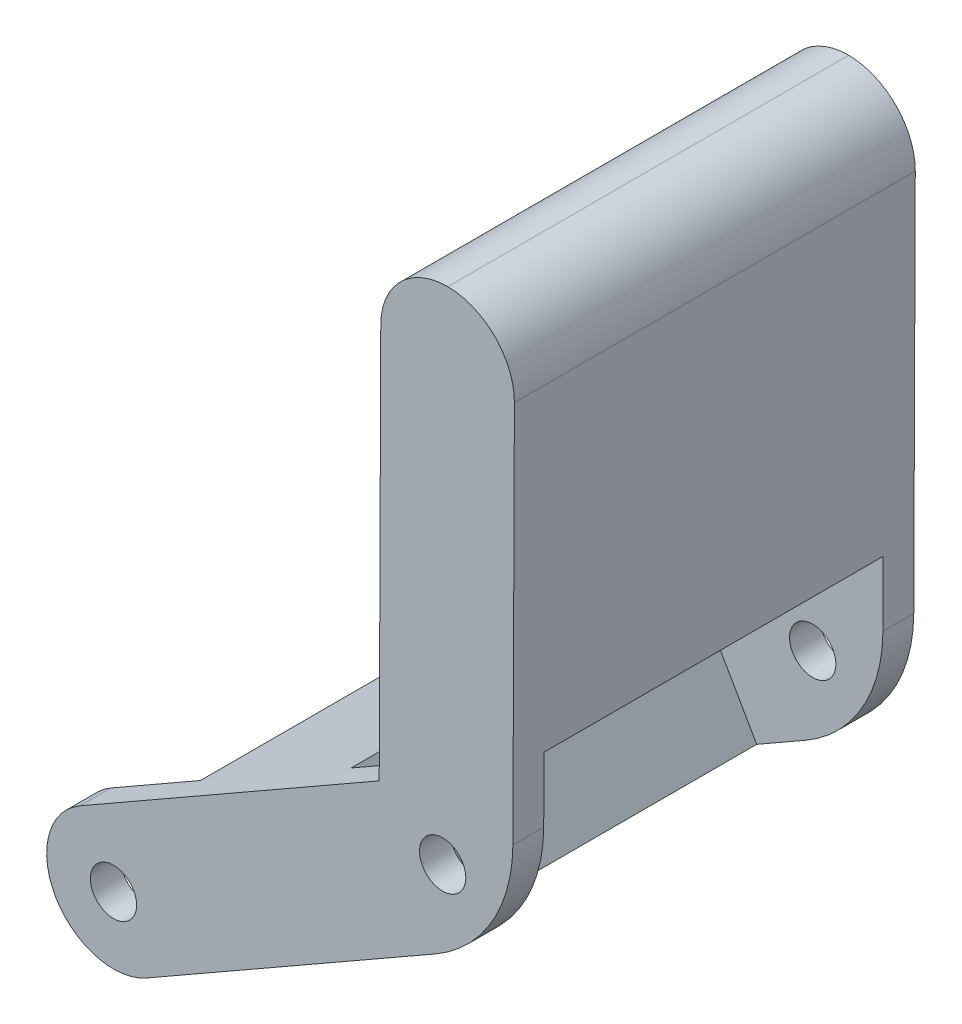
ISO-10303-21;
HEADER;
FILE_DESCRIPTION(('STEP AP214'),'2;1');
FILE_NAME('part.step','',(''),(''),'','','');
FILE_SCHEMA(('AUTOMOTIVE_DESIGN { 1 0 10303 214 1 1 1 1 }'));
ENDSEC;
DATA;
#1=APPLICATION_CONTEXT('core data for automotive mechanical design processes');
#2=APPLICATION_PROTOCOL_DEFINITION('international standard','automotive_design',2000,#1);
#3=PRODUCT_CONTEXT('',#1,'mechanical');
#4=PRODUCT('Part','Part','',(#3));
#5=PRODUCT_RELATED_PRODUCT_CATEGORY('part','',(#4));
#6=PRODUCT_DEFINITION_FORMATION('','',#4);
#7=PRODUCT_DEFINITION_CONTEXT('part definition',#1,'design');
#8=PRODUCT_DEFINITION('design','',#6,#7);
#9=PRODUCT_DEFINITION_SHAPE('','',#8);
#10=(LENGTH_UNIT() NAMED_UNIT(*) SI_UNIT(.MILLI.,.METRE.));
#11=(NAMED_UNIT(*) PLANE_ANGLE_UNIT() SI_UNIT($,.RADIAN.));
#12=(NAMED_UNIT(*) SI_UNIT($,.STERADIAN.) SOLID_ANGLE_UNIT());
#13=UNCERTAINTY_MEASURE_WITH_UNIT(LENGTH_MEASURE(1.E-05),#10,'distance_accuracy_value','');
#14=(GEOMETRIC_REPRESENTATION_CONTEXT(3) GLOBAL_UNCERTAINTY_ASSIGNED_CONTEXT((#13)) GLOBAL_UNIT_ASSIGNED_CONTEXT((#10,
#11,#12)) REPRESENTATION_CONTEXT('',''));
#15=CARTESIAN_POINT('',(0.,0.,0.));
#16=DIRECTION('',(0.,0.,1.));
#17=DIRECTION('',(1.,0.,0.));
#18=AXIS2_PLACEMENT_3D('',#15,#16,#17);
#19=CARTESIAN_POINT('',(-68.5457376919381,36.6889902020353,36.));
#20=DIRECTION('',(0.,0.,1.));
#21=DIRECTION('',(1.,0.,0.));
#22=AXIS2_PLACEMENT_3D('',#19,#20,#21);
#23=PLANE('',#22);
#24=CARTESIAN_POINT('',(-31.7182920612939,-14.593315758444,36.));
#25=DIRECTION('',(0.,0.,1.));
#26=DIRECTION('',(1.,0.,0.));
#27=AXIS2_PLACEMENT_3D('',#24,#25,#26);
#28=CIRCLE('',#27,2.25);
#29=CARTESIAN_POINT('',(-29.4682920612939,-14.593315758444,36.));
#30=VERTEX_POINT('',#29);
#31=EDGE_CURVE('E240',#30,#30,#28,.T.);
#32=ORIENTED_EDGE('',*,*,#31,.T.);
#33=EDGE_LOOP('',(#32));
#34=FACE_BOUND('',#33,.T.);
#35=DIRECTION('',(0.496581690759922,-0.867989990957279,0.));
#36=VECTOR('',#35,1.);
#37=CARTESIAN_POINT('',(-26.2661731416606,-3.98556390962247,36.0000000000014));
#38=LINE('',#37,#36);
#39=CARTESIAN_POINT('',(-26.2661731416606,-3.98556390962247,36.));
#40=VERTEX_POINT('',#39);
#41=CARTESIAN_POINT('',(-19.8106111617817,-15.2694337920671,36.0000000000014));
#42=VERTEX_POINT('',#41);
#43=EDGE_CURVE('E194',#40,#42,#38,.T.);
#44=ORIENTED_EDGE('',*,*,#43,.T.);
#45=DIRECTION('',(-0.867989990957278,-0.496581690759923,0.));
#46=VECTOR('',#45,1.);
#47=CARTESIAN_POINT('',(-34.1324460125767,-23.4630316896058,36.));
#48=LINE('',#47,#46);
#49=CARTESIAN_POINT('',(-28.4905110713544,-20.2352506996663,36.));
#50=VERTEX_POINT('',#49);
#51=EDGE_CURVE('E177',#42,#50,#48,.T.);
#52=ORIENTED_EDGE('',*,*,#51,.T.);
#53=CARTESIAN_POINT('',(-31.7182920612939,-14.593315758444,36.));
#54=DIRECTION('',(0.,0.,1.));
#55=DIRECTION('',(1.,0.,0.));
#56=AXIS2_PLACEMENT_3D('',#53,#54,#55);
#57=CIRCLE('',#56,6.5);
#58=CARTESIAN_POINT('',(-37.3602270025162,-17.8210967483835,36.));
#59=VERTEX_POINT('',#58);
#60=EDGE_CURVE('E312',#50,#59,#57,.F.);
#61=ORIENTED_EDGE('',*,*,#60,.T.);
#62=CARTESIAN_POINT('',(-31.7182920612939,-14.593315758444,36.));
#63=DIRECTION('',(0.,0.,1.));
#64=DIRECTION('',(1.,0.,0.));
#65=AXIS2_PLACEMENT_3D('',#62,#63,#64);
#66=CIRCLE('',#65,6.5);
#67=CARTESIAN_POINT('',(-34.9460730512334,-8.9513808172217,36.));
#68=VERTEX_POINT('',#67);
#69=EDGE_CURVE('E310',#59,#68,#66,.F.);
#70=ORIENTED_EDGE('',*,*,#69,.T.);
#71=DIRECTION('',(-0.867989990957279,-0.496581690759922,0.));
#72=VECTOR('',#71,1.);
#73=CARTESIAN_POINT('',(-5.86840835416459,7.6841058232357,36.));
#74=LINE('',#73,#72);
#75=EDGE_CURVE('E196',#40,#68,#74,.T.);
#76=ORIENTED_EDGE('',*,*,#75,.F.);
#77=EDGE_LOOP('',(#44,#52,#61,#70,#76));
#78=FACE_BOUND('',#77,.T.);
#79=ADVANCED_FACE('F33',(#34,#78),#23,.F.);
#80=CARTESIAN_POINT('',(0.306965546264745,3.72850446467224,36.));
#81=DIRECTION('',(0.,0.,1.));
#82=DIRECTION('',(1.,0.,0.));
#83=AXIS2_PLACEMENT_3D('',#80,#81,#82);
#84=CIRCLE('',#83,2.25);
#85=CARTESIAN_POINT('',(2.55696554626474,3.72850446467224,36.));
#86=VERTEX_POINT('',#85);
#87=EDGE_CURVE('E239',#86,#86,#84,.T.);
#88=ORIENTED_EDGE('',*,*,#87,.T.);
#89=EDGE_LOOP('',(#88));
#90=FACE_BOUND('',#89,.T.);
#91=DIRECTION('',(-0.496581690759922,0.867989990957279,0.));
#92=VECTOR('',#91,1.);
#93=CARTESIAN_POINT('',(-5.14515337336855,-6.8792473841493,36.0000000000014));
#94=LINE('',#93,#92);
#95=CARTESIAN_POINT('',(-5.14515337336855,-6.8792473841493,36.));
#96=VERTEX_POINT('',#95);
#97=CARTESIAN_POINT('',(-11.6007153532475,4.40462249829532,36.));
#98=VERTEX_POINT('',#97);
#99=EDGE_CURVE('E201',#96,#98,#94,.T.);
#100=ORIENTED_EDGE('',*,*,#99,.T.);
#101=CARTESIAN_POINT('',(-5.86840835416459,7.6841058232357,36.));
#102=VERTEX_POINT('',#101);
#103=EDGE_CURVE('E245',#102,#98,#74,.T.);
#104=ORIENTED_EDGE('',*,*,#103,.F.);
#105=DIRECTION('',(-0.00394263622631601,-0.99999222777959,0.));
#106=VECTOR('',#105,1.);
#107=CARTESIAN_POINT('',(-5.69098972398036,52.6837560733172,36.));
#108=LINE('',#107,#106);
#109=CARTESIAN_POINT('',(-5.75012926737511,37.6838726566235,36.));
#110=VERTEX_POINT('',#109);
#111=EDGE_CURVE('E248',#110,#102,#108,.T.);
#112=ORIENTED_EDGE('',*,*,#111,.F.);
#113=DIRECTION('',(0.496581690759923,-0.867989990957279,0.));
#114=VECTOR('',#113,1.);
#115=CARTESIAN_POINT('',(-20.8062881892878,64.000983193831,36.));
#116=LINE('',#115,#114);
#117=CARTESIAN_POINT('',(7.16099469238293,15.1161328917342,36.));
#118=VERTEX_POINT('',#117);
#119=EDGE_CURVE('E220',#110,#118,#116,.T.);
#120=ORIENTED_EDGE('',*,*,#119,.T.);
#121=DIRECTION('',(0.00394263622631592,0.99999222777959,0.));
#122=VECTOR('',#121,1.);
#123=CARTESIAN_POINT('',(7.10189893984454,0.127356387644555,36.));
#124=LINE('',#123,#122);
#125=CARTESIAN_POINT('',(7.13604317114325,8.78754311608577,36.));
#126=VERTEX_POINT('',#125);
#127=EDGE_CURVE('E243',#126,#118,#124,.T.);
#128=ORIENTED_EDGE('',*,*,#127,.F.);
#129=CARTESIAN_POINT('',(-7.8638402455506,8.84668265948051,36.));
#130=DIRECTION('',(0.,0.,1.));
#131=DIRECTION('',(1.,0.,0.));
#132=AXIS2_PLACEMENT_3D('',#129,#130,#131);
#133=CIRCLE('',#132,15.);
#134=CARTESIAN_POINT('',(-0.415114884151767,-4.17316720487868,36.));
#135=VERTEX_POINT('',#134);
#136=EDGE_CURVE('E332',#126,#135,#133,.F.);
#137=ORIENTED_EDGE('',*,*,#136,.T.);
#138=EDGE_CURVE('E190',#135,#96,#48,.T.);
#139=ORIENTED_EDGE('',*,*,#138,.T.);
#140=EDGE_LOOP('',(#100,#104,#112,#120,#128,#137,#139));
#141=FACE_BOUND('',#140,.T.);
#142=ADVANCED_FACE('F385',(#90,#141),#23,.F.);
#143=CARTESIAN_POINT('',(-68.5457376919381,36.6889902020353,3.));
#144=DIRECTION('',(0.,0.,-1.));
#145=DIRECTION('',(-1.,0.,0.));
#146=AXIS2_PLACEMENT_3D('',#143,#144,#145);
#147=PLANE('',#146);
#148=CARTESIAN_POINT('',(-31.7182920612939,-14.593315758444,3.));
#149=DIRECTION('',(0.,0.,-1.));
#150=DIRECTION('',(-1.,0.,0.));
#151=AXIS2_PLACEMENT_3D('',#148,#149,#150);
#152=CIRCLE('',#151,2.25);
#153=CARTESIAN_POINT('',(-33.9682920612939,-14.593315758444,3.));
#154=VERTEX_POINT('',#153);
#155=EDGE_CURVE('E226',#154,#154,#152,.T.);
#156=ORIENTED_EDGE('',*,*,#155,.T.);
#157=EDGE_LOOP('',(#156));
#158=FACE_BOUND('',#157,.T.);
#159=DIRECTION('',(0.496581690759922,-0.867989990957279,0.));
#160=VECTOR('',#159,1.);
#161=CARTESIAN_POINT('',(-26.2661731416606,-3.98556390962247,3.));
#162=LINE('',#161,#160);
#163=CARTESIAN_POINT('',(-26.2661731416606,-3.98556390962247,3.));
#164=VERTEX_POINT('',#163);
#165=CARTESIAN_POINT('',(-19.8106111617817,-15.2694337920671,3.));
#166=VERTEX_POINT('',#165);
#167=EDGE_CURVE('E204',#164,#166,#162,.T.);
#168=ORIENTED_EDGE('',*,*,#167,.F.);
#169=DIRECTION('',(0.867989990957279,0.496581690759922,0.));
#170=VECTOR('',#169,1.);
#171=CARTESIAN_POINT('',(-5.86840835416459,7.6841058232357,3.));
#172=LINE('',#171,#170);
#173=CARTESIAN_POINT('',(-34.9460730512334,-8.9513808172217,3.));
#174=VERTEX_POINT('',#173);
#175=EDGE_CURVE('E233',#174,#164,#172,.T.);
#176=ORIENTED_EDGE('',*,*,#175,.F.);
#177=CARTESIAN_POINT('',(-31.7182920612939,-14.593315758444,3.));
#178=DIRECTION('',(0.,0.,-1.));
#179=DIRECTION('',(-1.,0.,0.));
#180=AXIS2_PLACEMENT_3D('',#177,#178,#179);
#181=CIRCLE('',#180,6.5);
#182=CARTESIAN_POINT('',(-37.3602270025162,-17.8210967483835,3.));
#183=VERTEX_POINT('',#182);
#184=EDGE_CURVE('E303',#174,#183,#181,.F.);
#185=ORIENTED_EDGE('',*,*,#184,.T.);
#186=CARTESIAN_POINT('',(-31.7182920612939,-14.593315758444,3.));
#187=DIRECTION('',(0.,0.,-1.));
#188=DIRECTION('',(-1.,0.,0.));
#189=AXIS2_PLACEMENT_3D('',#186,#187,#188);
#190=CIRCLE('',#189,6.5);
#191=CARTESIAN_POINT('',(-28.4905110713544,-20.2352506996663,3.));
#192=VERTEX_POINT('',#191);
#193=EDGE_CURVE('E305',#183,#192,#190,.F.);
#194=ORIENTED_EDGE('',*,*,#193,.T.);
#195=DIRECTION('',(0.867989990957278,0.496581690759923,0.));
#196=VECTOR('',#195,1.);
#197=CARTESIAN_POINT('',(-34.1324460125767,-23.4630316896058,3.));
#198=LINE('',#197,#196);
#199=EDGE_CURVE('E191',#192,#166,#198,.T.);
#200=ORIENTED_EDGE('',*,*,#199,.T.);
#201=EDGE_LOOP('',(#168,#176,#185,#194,#200));
#202=FACE_BOUND('',#201,.T.);
#203=ADVANCED_FACE('F391',(#158,#202),#147,.F.);
#204=CARTESIAN_POINT('',(0.306965546264745,3.72850446467224,3.));
#205=DIRECTION('',(0.,0.,-1.));
#206=DIRECTION('',(-1.,0.,0.));
#207=AXIS2_PLACEMENT_3D('',#204,#205,#206);
#208=CIRCLE('',#207,2.25);
#209=CARTESIAN_POINT('',(-1.94303445373526,3.72850446467224,3.));
#210=VERTEX_POINT('',#209);
#211=EDGE_CURVE('E223',#210,#210,#208,.T.);
#212=ORIENTED_EDGE('',*,*,#211,.T.);
#213=EDGE_LOOP('',(#212));
#214=FACE_BOUND('',#213,.T.);
#215=DIRECTION('',(-0.496581690759922,0.867989990957279,0.));
#216=VECTOR('',#215,1.);
#217=CARTESIAN_POINT('',(-5.14515337336855,-6.8792473841493,3.));
#218=LINE('',#217,#216);
#219=CARTESIAN_POINT('',(-5.14515337336855,-6.8792473841493,3.));
#220=VERTEX_POINT('',#219);
#221=CARTESIAN_POINT('',(-11.6007153532475,4.40462249829532,3.));
#222=VERTEX_POINT('',#221);
#223=EDGE_CURVE('E214',#220,#222,#218,.T.);
#224=ORIENTED_EDGE('',*,*,#223,.F.);
#225=CARTESIAN_POINT('',(-0.415114884151774,-4.17316720487868,3.));
#226=VERTEX_POINT('',#225);
#227=EDGE_CURVE('E217',#220,#226,#198,.T.);
#228=ORIENTED_EDGE('',*,*,#227,.T.);
#229=CARTESIAN_POINT('',(-7.8638402455506,8.84668265948051,3.));
#230=DIRECTION('',(0.,0.,-1.));
#231=DIRECTION('',(-1.,0.,0.));
#232=AXIS2_PLACEMENT_3D('',#229,#230,#231);
#233=CIRCLE('',#232,15.);
#234=CARTESIAN_POINT('',(7.13604317114325,8.78754311608577,3.));
#235=VERTEX_POINT('',#234);
#236=EDGE_CURVE('E343',#226,#235,#233,.F.);
#237=ORIENTED_EDGE('',*,*,#236,.T.);
#238=DIRECTION('',(-0.00394263622631592,-0.99999222777959,0.));
#239=VECTOR('',#238,1.);
#240=CARTESIAN_POINT('',(7.10189893984454,0.127356387644555,3.));
#241=LINE('',#240,#239);
#242=CARTESIAN_POINT('',(7.16099469238293,15.1161328917342,3.));
#243=VERTEX_POINT('',#242);
#244=EDGE_CURVE('E229',#243,#235,#241,.T.);
#245=ORIENTED_EDGE('',*,*,#244,.F.);
#246=DIRECTION('',(0.496581690759923,-0.867989990957279,0.));
#247=VECTOR('',#246,1.);
#248=CARTESIAN_POINT('',(-20.8062881892877,64.000983193831,3.));
#249=LINE('',#248,#247);
#250=CARTESIAN_POINT('',(-5.75012926737511,37.6838726566235,3.));
#251=VERTEX_POINT('',#250);
#252=EDGE_CURVE('E219',#251,#243,#249,.T.);
#253=ORIENTED_EDGE('',*,*,#252,.F.);
#254=DIRECTION('',(0.00394263622631601,0.99999222777959,0.));
#255=VECTOR('',#254,1.);
#256=CARTESIAN_POINT('',(-5.69098972398036,52.6837560733172,3.));
#257=LINE('',#256,#255);
#258=CARTESIAN_POINT('',(-5.86840835416459,7.6841058232357,3.));
#259=VERTEX_POINT('',#258);
#260=EDGE_CURVE('E236',#259,#251,#257,.T.);
#261=ORIENTED_EDGE('',*,*,#260,.F.);
#262=EDGE_CURVE('E232',#222,#259,#172,.T.);
#263=ORIENTED_EDGE('',*,*,#262,.F.);
#264=EDGE_LOOP('',(#224,#228,#237,#245,#253,#261,#263));
#265=FACE_BOUND('',#264,.T.);
#266=ADVANCED_FACE('F402',(#214,#265),#147,.F.);
#267=CARTESIAN_POINT('',(-31.7182920612939,-14.593315758444,39.));
#268=DIRECTION('',(0.,0.,-1.));
#269=DIRECTION('',(-1.,0.,0.));
#270=AXIS2_PLACEMENT_3D('',#267,#268,#269);
#271=CYLINDRICAL_SURFACE('',#270,2.25);
#272=ORIENTED_EDGE('',*,*,#31,.F.);
#273=EDGE_LOOP('',(#272));
#274=FACE_BOUND('',#273,.T.);
#275=CARTESIAN_POINT('',(-31.7182920612939,-14.593315758444,39.));
#276=DIRECTION('',(0.,0.,1.));
#277=DIRECTION('',(1.,0.,0.));
#278=AXIS2_PLACEMENT_3D('',#275,#276,#277);
#279=CIRCLE('',#278,2.25);
#280=CARTESIAN_POINT('',(-29.4682920612939,-14.593315758444,39.));
#281=VERTEX_POINT('',#280);
#282=EDGE_CURVE('E261',#281,#281,#279,.T.);
#283=ORIENTED_EDGE('',*,*,#282,.T.);
#284=EDGE_LOOP('',(#283));
#285=FACE_BOUND('',#284,.T.);
#286=ADVANCED_FACE('F413',(#274,#285),#271,.F.);
#287=CARTESIAN_POINT('',(0.306965546264745,3.72850446467224,39.));
#288=DIRECTION('',(0.,0.,-1.));
#289=DIRECTION('',(-1.,0.,0.));
#290=AXIS2_PLACEMENT_3D('',#287,#288,#289);
#291=CYLINDRICAL_SURFACE('',#290,2.25);
#292=ORIENTED_EDGE('',*,*,#87,.F.);
#293=EDGE_LOOP('',(#292));
#294=FACE_BOUND('',#293,.T.);
#295=CARTESIAN_POINT('',(0.306965546264745,3.72850446467224,39.));
#296=DIRECTION('',(0.,0.,1.));
#297=DIRECTION('',(1.,0.,0.));
#298=AXIS2_PLACEMENT_3D('',#295,#296,#297);
#299=CIRCLE('',#298,2.25);
#300=CARTESIAN_POINT('',(2.55696554626474,3.72850446467224,39.));
#301=VERTEX_POINT('',#300);
#302=EDGE_CURVE('E255',#301,#301,#299,.T.);
#303=ORIENTED_EDGE('',*,*,#302,.T.);
#304=EDGE_LOOP('',(#303));
#305=FACE_BOUND('',#304,.T.);
#306=ADVANCED_FACE('F408',(#294,#305),#291,.F.);
#307=CARTESIAN_POINT('',(0.,0.,39.));
#308=DIRECTION('',(0.,0.,1.));
#309=DIRECTION('',(1.,0.,0.));
#310=AXIS2_PLACEMENT_3D('',#307,#308,#309);
#311=PLANE('',#310);
#312=ORIENTED_EDGE('',*,*,#282,.F.);
#313=EDGE_LOOP('',(#312));
#314=FACE_BOUND('',#313,.T.);
#315=CARTESIAN_POINT('',(0.783332621115914,46.1581794572789,39.));
#316=DIRECTION('',(0.,0.,1.));
#317=DIRECTION('',(1.,0.,0.));
#318=AXIS2_PLACEMENT_3D('',#315,#316,#317);
#319=CIRCLE('',#318,6.5);
#320=CARTESIAN_POINT('',(7.28328210168325,46.1325523218078,39.));
#321=VERTEX_POINT('',#320);
#322=CARTESIAN_POINT('',(0.808959756586968,52.6581289378462,39.));
#323=VERTEX_POINT('',#322);
#324=EDGE_CURVE('E49',#321,#323,#319,.T.);
#325=ORIENTED_EDGE('',*,*,#324,.T.);
#326=CARTESIAN_POINT('',(0.783332621115915,46.1581794572789,39.));
#327=DIRECTION('',(0.,0.,1.));
#328=DIRECTION('',(1.,0.,0.));
#329=AXIS2_PLACEMENT_3D('',#326,#327,#328);
#330=CIRCLE('',#329,6.5);
#331=CARTESIAN_POINT('',(-5.71661685945142,46.1838065927499,39.));
#332=VERTEX_POINT('',#331);
#333=EDGE_CURVE('E42',#323,#332,#330,.T.);
#334=ORIENTED_EDGE('',*,*,#333,.T.);
#335=DIRECTION('',(-0.00394263622631601,-0.99999222777959,0.));
#336=VECTOR('',#335,1.);
#337=CARTESIAN_POINT('',(-5.69098972398036,52.6837560733172,39.));
#338=LINE('',#337,#336);
#339=CARTESIAN_POINT('',(-5.86840835416459,7.6841058232357,39.));
#340=VERTEX_POINT('',#339);
#341=EDGE_CURVE('E267',#332,#340,#338,.T.);
#342=ORIENTED_EDGE('',*,*,#341,.T.);
#343=DIRECTION('',(-0.867989990957279,-0.496581690759922,0.));
#344=VECTOR('',#343,1.);
#345=CARTESIAN_POINT('',(-5.86840835416459,7.6841058232357,39.));
#346=LINE('',#345,#344);
#347=CARTESIAN_POINT('',(-34.9460730512334,-8.9513808172217,39.));
#348=VERTEX_POINT('',#347);
#349=EDGE_CURVE('E269',#340,#348,#346,.T.);
#350=ORIENTED_EDGE('',*,*,#349,.T.);
#351=CARTESIAN_POINT('',(-31.7182920612939,-14.593315758444,39.));
#352=DIRECTION('',(0.,0.,1.));
#353=DIRECTION('',(1.,0.,0.));
#354=AXIS2_PLACEMENT_3D('',#351,#352,#353);
#355=CIRCLE('',#354,6.5);
#356=CARTESIAN_POINT('',(-37.3602270025163,-17.8210967483835,39.));
#357=VERTEX_POINT('',#356);
#358=EDGE_CURVE('E314',#348,#357,#355,.T.);
#359=ORIENTED_EDGE('',*,*,#358,.T.);
#360=CARTESIAN_POINT('',(-31.7182920612939,-14.593315758444,39.));
#361=DIRECTION('',(0.,0.,1.));
#362=DIRECTION('',(1.,0.,0.));
#363=AXIS2_PLACEMENT_3D('',#360,#361,#362);
#364=CIRCLE('',#363,6.5);
#365=CARTESIAN_POINT('',(-28.4905110713544,-20.2352506996663,39.));
#366=VERTEX_POINT('',#365);
#367=EDGE_CURVE('E316',#357,#366,#364,.T.);
#368=ORIENTED_EDGE('',*,*,#367,.T.);
#369=DIRECTION('',(0.867989990957279,0.496581690759923,0.));
#370=VECTOR('',#369,1.);
#371=CARTESIAN_POINT('',(-34.1324460125768,-23.4630316896058,39.));
#372=LINE('',#371,#370);
#373=CARTESIAN_POINT('',(-0.41511488415176,-4.17316720487867,39.));
#374=VERTEX_POINT('',#373);
#375=EDGE_CURVE('E273',#366,#374,#372,.T.);
#376=ORIENTED_EDGE('',*,*,#375,.T.);
#377=CARTESIAN_POINT('',(-7.8638402455506,8.84668265948051,39.));
#378=DIRECTION('',(0.,0.,1.));
#379=DIRECTION('',(1.,0.,0.));
#380=AXIS2_PLACEMENT_3D('',#377,#378,#379);
#381=CIRCLE('',#380,15.);
#382=CARTESIAN_POINT('',(7.13604317114325,8.78754311608577,39.));
#383=VERTEX_POINT('',#382);
#384=EDGE_CURVE('E336',#374,#383,#381,.T.);
#385=ORIENTED_EDGE('',*,*,#384,.T.);
#386=DIRECTION('',(0.00394263622631592,0.99999222777959,0.));
#387=VECTOR('',#386,1.);
#388=CARTESIAN_POINT('',(7.10189893984454,0.127356387644555,39.));
#389=LINE('',#388,#387);
#390=EDGE_CURVE('E276',#383,#321,#389,.T.);
#391=ORIENTED_EDGE('',*,*,#390,.T.);
#392=EDGE_LOOP('',(#325,#334,#342,#350,#359,#368,#376,#385,#391));
#393=FACE_BOUND('',#392,.T.);
#394=ORIENTED_EDGE('',*,*,#302,.F.);
#395=EDGE_LOOP('',(#394));
#396=FACE_BOUND('',#395,.T.);
#397=ADVANCED_FACE('F355',(#314,#393,#396),#311,.T.);
#398=CARTESIAN_POINT('',(0.,0.,0.));
#399=DIRECTION('',(0.,0.,1.));
#400=DIRECTION('',(1.,0.,0.));
#401=AXIS2_PLACEMENT_3D('',#398,#399,#400);
#402=PLANE('',#401);
#403=DIRECTION('',(-0.00394263622631601,-0.99999222777959,0.));
#404=VECTOR('',#403,1.);
#405=CARTESIAN_POINT('',(-5.69098972398036,52.6837560733172,0.));
#406=LINE('',#405,#404);
#407=CARTESIAN_POINT('',(-5.71661685945142,46.1838065927499,0.));
#408=VERTEX_POINT('',#407);
#409=CARTESIAN_POINT('',(-5.86840835416459,7.6841058232357,0.));
#410=VERTEX_POINT('',#409);
#411=EDGE_CURVE('E264',#408,#410,#406,.T.);
#412=ORIENTED_EDGE('',*,*,#411,.F.);
#413=CARTESIAN_POINT('',(0.783332621115915,46.1581794572789,0.));
#414=DIRECTION('',(0.,0.,1.));
#415=DIRECTION('',(1.,0.,0.));
#416=AXIS2_PLACEMENT_3D('',#413,#414,#415);
#417=CIRCLE('',#416,6.5);
#418=CARTESIAN_POINT('',(0.808959756586968,52.6581289378462,0.));
#419=VERTEX_POINT('',#418);
#420=EDGE_CURVE('E350',#408,#419,#417,.F.);
#421=ORIENTED_EDGE('',*,*,#420,.T.);
#422=CARTESIAN_POINT('',(0.783332621115914,46.1581794572789,0.));
#423=DIRECTION('',(0.,0.,1.));
#424=DIRECTION('',(1.,0.,0.));
#425=AXIS2_PLACEMENT_3D('',#422,#423,#424);
#426=CIRCLE('',#425,6.5);
#427=CARTESIAN_POINT('',(7.28328210168325,46.1325523218078,0.));
#428=VERTEX_POINT('',#427);
#429=EDGE_CURVE('E348',#419,#428,#426,.F.);
#430=ORIENTED_EDGE('',*,*,#429,.T.);
#431=DIRECTION('',(0.00394263622631592,0.99999222777959,0.));
#432=VECTOR('',#431,1.);
#433=CARTESIAN_POINT('',(7.10189893984454,0.127356387644555,0.));
#434=LINE('',#433,#432);
#435=CARTESIAN_POINT('',(7.13604317114325,8.78754311608577,0.));
#436=VERTEX_POINT('',#435);
#437=EDGE_CURVE('E270',#436,#428,#434,.T.);
#438=ORIENTED_EDGE('',*,*,#437,.F.);
#439=CARTESIAN_POINT('',(-7.8638402455506,8.84668265948051,0.));
#440=DIRECTION('',(0.,0.,1.));
#441=DIRECTION('',(1.,0.,0.));
#442=AXIS2_PLACEMENT_3D('',#439,#440,#441);
#443=CIRCLE('',#442,15.);
#444=CARTESIAN_POINT('',(-0.41511488415176,-4.17316720487867,0.));
#445=VERTEX_POINT('',#444);
#446=EDGE_CURVE('E338',#436,#445,#443,.F.);
#447=ORIENTED_EDGE('',*,*,#446,.T.);
#448=DIRECTION('',(0.867989990957279,0.496581690759923,0.));
#449=VECTOR('',#448,1.);
#450=CARTESIAN_POINT('',(-34.1324460125768,-23.4630316896058,0.));
#451=LINE('',#450,#449);
#452=CARTESIAN_POINT('',(-28.4905110713544,-20.2352506996663,0.));
#453=VERTEX_POINT('',#452);
#454=EDGE_CURVE('E283',#453,#445,#451,.T.);
#455=ORIENTED_EDGE('',*,*,#454,.F.);
#456=CARTESIAN_POINT('',(-31.7182920612939,-14.593315758444,0.));
#457=DIRECTION('',(0.,0.,1.));
#458=DIRECTION('',(1.,0.,0.));
#459=AXIS2_PLACEMENT_3D('',#456,#457,#458);
#460=CIRCLE('',#459,6.5);
#461=CARTESIAN_POINT('',(-37.3602270025163,-17.8210967483835,0.));
#462=VERTEX_POINT('',#461);
#463=EDGE_CURVE('E301',#453,#462,#460,.F.);
#464=ORIENTED_EDGE('',*,*,#463,.T.);
#465=CARTESIAN_POINT('',(-31.7182920612939,-14.593315758444,0.));
#466=DIRECTION('',(0.,0.,1.));
#467=DIRECTION('',(1.,0.,0.));
#468=AXIS2_PLACEMENT_3D('',#465,#466,#467);
#469=CIRCLE('',#468,6.5);
#470=CARTESIAN_POINT('',(-34.9460730512334,-8.9513808172217,0.));
#471=VERTEX_POINT('',#470);
#472=EDGE_CURVE('E299',#462,#471,#469,.F.);
#473=ORIENTED_EDGE('',*,*,#472,.T.);
#474=DIRECTION('',(-0.867989990957279,-0.496581690759922,0.));
#475=VECTOR('',#474,1.);
#476=CARTESIAN_POINT('',(-5.86840835416459,7.6841058232357,0.));
#477=LINE('',#476,#475);
#478=EDGE_CURVE('E280',#410,#471,#477,.T.);
#479=ORIENTED_EDGE('',*,*,#478,.F.);
#480=EDGE_LOOP('',(#412,#421,#430,#438,#447,#455,#464,#473,#479));
#481=FACE_BOUND('',#480,.T.);
#482=CARTESIAN_POINT('',(-31.7182920612939,-14.593315758444,0.));
#483=DIRECTION('',(0.,0.,1.));
#484=DIRECTION('',(1.,0.,0.));
#485=AXIS2_PLACEMENT_3D('',#482,#483,#484);
#486=CIRCLE('',#485,2.25);
#487=CARTESIAN_POINT('',(-29.4682920612939,-14.593315758444,0.));
#488=VERTEX_POINT('',#487);
#489=EDGE_CURVE('E258',#488,#488,#486,.T.);
#490=ORIENTED_EDGE('',*,*,#489,.T.);
#491=EDGE_LOOP('',(#490));
#492=FACE_BOUND('',#491,.T.);
#493=CARTESIAN_POINT('',(0.306965546264745,3.72850446467224,0.));
#494=DIRECTION('',(0.,0.,1.));
#495=DIRECTION('',(1.,0.,0.));
#496=AXIS2_PLACEMENT_3D('',#493,#494,#495);
#497=CIRCLE('',#496,2.25);
#498=CARTESIAN_POINT('',(2.55696554626474,3.72850446467224,0.));
#499=VERTEX_POINT('',#498);
#500=EDGE_CURVE('E254',#499,#499,#497,.T.);
#501=ORIENTED_EDGE('',*,*,#500,.T.);
#502=EDGE_LOOP('',(#501));
#503=FACE_BOUND('',#502,.T.);
#504=ADVANCED_FACE('F368',(#481,#492,#503),#402,.F.);
#505=CARTESIAN_POINT('',(-5.69098972398036,52.6837560733172,39.));
#506=DIRECTION('',(0.99999222777959,-0.00394263622631601,0.));
#507=DIRECTION('',(0.00394263622631601,0.99999222777959,0.));
#508=AXIS2_PLACEMENT_3D('',#505,#506,#507);
#509=PLANE('',#508);
#510=ORIENTED_EDGE('',*,*,#341,.F.);
#511=DIRECTION('',(0.,0.,-1.));
#512=VECTOR('',#511,1.);
#513=CARTESIAN_POINT('',(-5.71661685945142,46.1838065927499,39.));
#514=LINE('',#513,#512);
#515=EDGE_CURVE('E345',#332,#408,#514,.T.);
#516=ORIENTED_EDGE('',*,*,#515,.T.);
#517=ORIENTED_EDGE('',*,*,#411,.T.);
#518=DIRECTION('',(0.,0.,-1.));
#519=VECTOR('',#518,1.);
#520=CARTESIAN_POINT('',(-5.86840835416459,7.6841058232357,39.));
#521=LINE('',#520,#519);
#522=EDGE_CURVE('E278',#259,#410,#521,.T.);
#523=ORIENTED_EDGE('',*,*,#522,.F.);
#524=ORIENTED_EDGE('',*,*,#260,.T.);
#525=DIRECTION('',(0.,0.,1.));
#526=VECTOR('',#525,1.);
#527=CARTESIAN_POINT('',(-5.7501292673751,37.6838726566235,39.));
#528=LINE('',#527,#526);
#529=EDGE_CURVE('E251',#251,#110,#528,.T.);
#530=ORIENTED_EDGE('',*,*,#529,.T.);
#531=ORIENTED_EDGE('',*,*,#111,.T.);
#532=EDGE_CURVE('E286',#340,#102,#521,.T.);
#533=ORIENTED_EDGE('',*,*,#532,.F.);
#534=EDGE_LOOP('',(#510,#516,#517,#523,#524,#530,#531,#533));
#535=FACE_BOUND('',#534,.T.);
#536=ADVANCED_FACE('F362',(#535),#509,.F.);
#537=CARTESIAN_POINT('',(-5.86840835416459,7.6841058232357,39.));
#538=DIRECTION('',(0.496581690759922,-0.867989990957279,0.));
#539=DIRECTION('',(0.867989990957279,0.496581690759922,0.));
#540=AXIS2_PLACEMENT_3D('',#537,#538,#539);
#541=PLANE('',#540);
#542=ORIENTED_EDGE('',*,*,#478,.T.);
#543=DIRECTION('',(0.,0.,-1.));
#544=VECTOR('',#543,1.);
#545=CARTESIAN_POINT('',(-34.9460730512334,-8.9513808172217,39.));
#546=LINE('',#545,#544);
#547=EDGE_CURVE('E307',#471,#174,#546,.F.);
#548=ORIENTED_EDGE('',*,*,#547,.T.);
#549=ORIENTED_EDGE('',*,*,#175,.T.);
#550=DIRECTION('',(0.,0.,-1.));
#551=VECTOR('',#550,1.);
#552=CARTESIAN_POINT('',(-26.2661731416606,-3.98556390962247,500000.));
#553=LINE('',#552,#551);
#554=EDGE_CURVE('E200',#40,#164,#553,.T.);
#555=ORIENTED_EDGE('',*,*,#554,.F.);
#556=ORIENTED_EDGE('',*,*,#75,.T.);
#557=DIRECTION('',(0.,0.,-1.));
#558=VECTOR('',#557,1.);
#559=CARTESIAN_POINT('',(-34.9460730512334,-8.9513808172217,39.));
#560=LINE('',#559,#558);
#561=EDGE_CURVE('E318',#68,#348,#560,.F.);
#562=ORIENTED_EDGE('',*,*,#561,.T.);
#563=ORIENTED_EDGE('',*,*,#349,.F.);
#564=ORIENTED_EDGE('',*,*,#532,.T.);
#565=ORIENTED_EDGE('',*,*,#103,.T.);
#566=DIRECTION('',(0.,0.,-1.));
#567=VECTOR('',#566,1.);
#568=CARTESIAN_POINT('',(-11.6007153532475,4.40462249829532,500000.));
#569=LINE('',#568,#567);
#570=EDGE_CURVE('E208',#98,#222,#569,.T.);
#571=ORIENTED_EDGE('',*,*,#570,.T.);
#572=ORIENTED_EDGE('',*,*,#262,.T.);
#573=ORIENTED_EDGE('',*,*,#522,.T.);
#574=EDGE_LOOP('',(#542,#548,#549,#555,#556,#562,#563,#564,#565,#571,#572,#573));
#575=FACE_BOUND('',#574,.T.);
#576=ADVANCED_FACE('F423',(#575),#541,.F.);
#577=CARTESIAN_POINT('',(-34.1324460125768,-23.4630316896058,39.));
#578=DIRECTION('',(-0.496581690759923,0.867989990957279,0.));
#579=DIRECTION('',(-0.867989990957279,-0.496581690759923,0.));
#580=AXIS2_PLACEMENT_3D('',#577,#578,#579);
#581=PLANE('',#580);
#582=ORIENTED_EDGE('',*,*,#454,.T.);
#583=DIRECTION('',(0.,0.,-1.));
#584=VECTOR('',#583,1.);
#585=CARTESIAN_POINT('',(-0.415114884151767,-4.17316720487867,39.));
#586=LINE('',#585,#584);
#587=EDGE_CURVE('E340',#445,#226,#586,.F.);
#588=ORIENTED_EDGE('',*,*,#587,.T.);
#589=ORIENTED_EDGE('',*,*,#227,.F.);
#590=DIRECTION('',(0.,0.,-1.));
#591=VECTOR('',#590,1.);
#592=CARTESIAN_POINT('',(-5.14515337336855,-6.8792473841493,500000.));
#593=LINE('',#592,#591);
#594=EDGE_CURVE('E205',#96,#220,#593,.T.);
#595=ORIENTED_EDGE('',*,*,#594,.F.);
#596=ORIENTED_EDGE('',*,*,#138,.F.);
#597=DIRECTION('',(0.,0.,-1.));
#598=VECTOR('',#597,1.);
#599=CARTESIAN_POINT('',(-0.415114884151767,-4.17316720487867,39.));
#600=LINE('',#599,#598);
#601=EDGE_CURVE('E334',#135,#374,#600,.F.);
#602=ORIENTED_EDGE('',*,*,#601,.T.);
#603=ORIENTED_EDGE('',*,*,#375,.F.);
#604=DIRECTION('',(0.,0.,-1.));
#605=VECTOR('',#604,1.);
#606=CARTESIAN_POINT('',(-28.4905110713544,-20.2352506996663,39.));
#607=LINE('',#606,#605);
#608=EDGE_CURVE('E187',#366,#50,#607,.T.);
#609=ORIENTED_EDGE('',*,*,#608,.T.);
#610=ORIENTED_EDGE('',*,*,#51,.F.);
#611=DIRECTION('',(0.,0.,-1.));
#612=VECTOR('',#611,1.);
#613=CARTESIAN_POINT('',(-19.8106111617817,-15.2694337920671,500000.));
#614=LINE('',#613,#612);
#615=EDGE_CURVE('E183',#42,#166,#614,.T.);
#616=ORIENTED_EDGE('',*,*,#615,.T.);
#617=ORIENTED_EDGE('',*,*,#199,.F.);
#618=DIRECTION('',(0.,0.,-1.));
#619=VECTOR('',#618,1.);
#620=CARTESIAN_POINT('',(-28.4905110713544,-20.2352506996663,39.));
#621=LINE('',#620,#619);
#622=EDGE_CURVE('E296',#192,#453,#621,.T.);
#623=ORIENTED_EDGE('',*,*,#622,.T.);
#624=EDGE_LOOP('',(#582,#588,#589,#595,#596,#602,#603,#609,#610,#616,#617,#623));
#625=FACE_BOUND('',#624,.T.);
#626=ADVANCED_FACE('F180',(#625),#581,.F.);
#627=CARTESIAN_POINT('',(7.10189893984454,0.127356387644555,39.));
#628=DIRECTION('',(-0.99999222777959,0.00394263622631592,0.));
#629=DIRECTION('',(-0.00394263622631592,-0.99999222777959,0.));
#630=AXIS2_PLACEMENT_3D('',#627,#628,#629);
#631=PLANE('',#630);
#632=ORIENTED_EDGE('',*,*,#437,.T.);
#633=DIRECTION('',(0.,0.,-1.));
#634=VECTOR('',#633,1.);
#635=CARTESIAN_POINT('',(7.28328210168325,46.1325523218078,39.));
#636=LINE('',#635,#634);
#637=EDGE_CURVE('E11',#428,#321,#636,.F.);
#638=ORIENTED_EDGE('',*,*,#637,.T.);
#639=ORIENTED_EDGE('',*,*,#390,.F.);
#640=DIRECTION('',(0.,0.,-1.));
#641=VECTOR('',#640,1.);
#642=CARTESIAN_POINT('',(7.13604317114325,8.78754311608577,39.));
#643=LINE('',#642,#641);
#644=EDGE_CURVE('E329',#383,#126,#643,.T.);
#645=ORIENTED_EDGE('',*,*,#644,.T.);
#646=ORIENTED_EDGE('',*,*,#127,.T.);
#647=DIRECTION('',(0.,0.,-1.));
#648=VECTOR('',#647,1.);
#649=CARTESIAN_POINT('',(7.16099469238293,15.1161328917342,39.));
#650=LINE('',#649,#648);
#651=EDGE_CURVE('E289',#118,#243,#650,.T.);
#652=ORIENTED_EDGE('',*,*,#651,.T.);
#653=ORIENTED_EDGE('',*,*,#244,.T.);
#654=DIRECTION('',(0.,0.,-1.));
#655=VECTOR('',#654,1.);
#656=CARTESIAN_POINT('',(7.13604317114325,8.78754311608577,39.));
#657=LINE('',#656,#655);
#658=EDGE_CURVE('E320',#235,#436,#657,.T.);
#659=ORIENTED_EDGE('',*,*,#658,.T.);
#660=EDGE_LOOP('',(#632,#638,#639,#645,#646,#652,#653,#659));
#661=FACE_BOUND('',#660,.T.);
#662=ADVANCED_FACE('F411',(#661),#631,.F.);
#663=ORIENTED_EDGE('',*,*,#155,.F.);
#664=EDGE_LOOP('',(#663));
#665=FACE_BOUND('',#664,.T.);
#666=ORIENTED_EDGE('',*,*,#489,.F.);
#667=EDGE_LOOP('',(#666));
#668=FACE_BOUND('',#667,.T.);
#669=ADVANCED_FACE('F406',(#665,#668),#271,.F.);
#670=ORIENTED_EDGE('',*,*,#211,.F.);
#671=EDGE_LOOP('',(#670));
#672=FACE_BOUND('',#671,.T.);
#673=ORIENTED_EDGE('',*,*,#500,.F.);
#674=EDGE_LOOP('',(#673));
#675=FACE_BOUND('',#674,.T.);
#676=ADVANCED_FACE('F398',(#672,#675),#291,.F.);
#677=CARTESIAN_POINT('',(-20.8062881892878,64.000983193831,36.));
#678=DIRECTION('',(0.867989990957279,0.496581690759923,0.));
#679=DIRECTION('',(-0.496581690759923,0.867989990957279,0.));
#680=AXIS2_PLACEMENT_3D('',#677,#678,#679);
#681=PLANE('',#680);
#682=ORIENTED_EDGE('',*,*,#252,.T.);
#683=ORIENTED_EDGE('',*,*,#651,.F.);
#684=ORIENTED_EDGE('',*,*,#119,.F.);
#685=ORIENTED_EDGE('',*,*,#529,.F.);
#686=EDGE_LOOP('',(#682,#683,#684,#685));
#687=FACE_BOUND('',#686,.T.);
#688=ADVANCED_FACE('F394',(#687),#681,.F.);
#689=CARTESIAN_POINT('',(-31.7182920612939,-14.593315758444,39.));
#690=DIRECTION('',(0.,0.,-1.));
#691=DIRECTION('',(-1.,0.,0.));
#692=AXIS2_PLACEMENT_3D('',#689,#690,#691);
#693=CYLINDRICAL_SURFACE('',#692,6.5);
#694=DIRECTION('',(0.,0.,-1.));
#695=VECTOR('',#694,1.);
#696=CARTESIAN_POINT('',(-37.3602270025163,-17.8210967483835,39.));
#697=LINE('',#696,#695);
#698=EDGE_CURVE('E321',#183,#462,#697,.T.);
#699=ORIENTED_EDGE('',*,*,#698,.F.);
#700=ORIENTED_EDGE('',*,*,#184,.F.);
#701=ORIENTED_EDGE('',*,*,#547,.F.);
#702=ORIENTED_EDGE('',*,*,#472,.F.);
#703=EDGE_LOOP('',(#699,#700,#701,#702));
#704=FACE_BOUND('',#703,.T.);
#705=ADVANCED_FACE('F397',(#704),#693,.T.);
#706=CARTESIAN_POINT('',(-31.7182920612939,-14.593315758444,39.));
#707=DIRECTION('',(0.,0.,-1.));
#708=DIRECTION('',(-1.,0.,0.));
#709=AXIS2_PLACEMENT_3D('',#706,#707,#708);
#710=CYLINDRICAL_SURFACE('',#709,6.5);
#711=ORIENTED_EDGE('',*,*,#193,.F.);
#712=ORIENTED_EDGE('',*,*,#698,.T.);
#713=ORIENTED_EDGE('',*,*,#463,.F.);
#714=ORIENTED_EDGE('',*,*,#622,.F.);
#715=EDGE_LOOP('',(#711,#712,#713,#714));
#716=FACE_BOUND('',#715,.T.);
#717=ADVANCED_FACE('F429',(#716),#710,.T.);
#718=CARTESIAN_POINT('',(-31.7182920612939,-14.593315758444,39.));
#719=DIRECTION('',(0.,0.,-1.));
#720=DIRECTION('',(-1.,0.,0.));
#721=AXIS2_PLACEMENT_3D('',#718,#719,#720);
#722=CYLINDRICAL_SURFACE('',#721,6.5);
#723=DIRECTION('',(0.,0.,-1.));
#724=VECTOR('',#723,1.);
#725=CARTESIAN_POINT('',(-37.3602270025163,-17.8210967483835,39.));
#726=LINE('',#725,#724);
#727=EDGE_CURVE('E324',#357,#59,#726,.T.);
#728=ORIENTED_EDGE('',*,*,#727,.F.);
#729=ORIENTED_EDGE('',*,*,#358,.F.);
#730=ORIENTED_EDGE('',*,*,#561,.F.);
#731=ORIENTED_EDGE('',*,*,#69,.F.);
#732=EDGE_LOOP('',(#728,#729,#730,#731));
#733=FACE_BOUND('',#732,.T.);
#734=ADVANCED_FACE('F432',(#733),#722,.T.);
#735=CARTESIAN_POINT('',(-31.7182920612939,-14.593315758444,39.));
#736=DIRECTION('',(0.,0.,-1.));
#737=DIRECTION('',(-1.,0.,0.));
#738=AXIS2_PLACEMENT_3D('',#735,#736,#737);
#739=CYLINDRICAL_SURFACE('',#738,6.5);
#740=ORIENTED_EDGE('',*,*,#367,.F.);
#741=ORIENTED_EDGE('',*,*,#727,.T.);
#742=ORIENTED_EDGE('',*,*,#60,.F.);
#743=ORIENTED_EDGE('',*,*,#608,.F.);
#744=EDGE_LOOP('',(#740,#741,#742,#743));
#745=FACE_BOUND('',#744,.T.);
#746=ADVANCED_FACE('F437',(#745),#739,.T.);
#747=CARTESIAN_POINT('',(-7.8638402455506,8.84668265948051,39.));
#748=DIRECTION('',(0.,0.,-1.));
#749=DIRECTION('',(-1.,0.,0.));
#750=AXIS2_PLACEMENT_3D('',#747,#748,#749);
#751=CYLINDRICAL_SURFACE('',#750,15.);
#752=ORIENTED_EDGE('',*,*,#384,.F.);
#753=ORIENTED_EDGE('',*,*,#601,.F.);
#754=ORIENTED_EDGE('',*,*,#136,.F.);
#755=ORIENTED_EDGE('',*,*,#644,.F.);
#756=EDGE_LOOP('',(#752,#753,#754,#755));
#757=FACE_BOUND('',#756,.T.);
#758=ADVANCED_FACE('F440',(#757),#751,.T.);
#759=CARTESIAN_POINT('',(-7.8638402455506,8.84668265948051,39.));
#760=DIRECTION('',(0.,0.,-1.));
#761=DIRECTION('',(-1.,0.,0.));
#762=AXIS2_PLACEMENT_3D('',#759,#760,#761);
#763=CYLINDRICAL_SURFACE('',#762,15.);
#764=ORIENTED_EDGE('',*,*,#236,.F.);
#765=ORIENTED_EDGE('',*,*,#587,.F.);
#766=ORIENTED_EDGE('',*,*,#446,.F.);
#767=ORIENTED_EDGE('',*,*,#658,.F.);
#768=EDGE_LOOP('',(#764,#765,#766,#767));
#769=FACE_BOUND('',#768,.T.);
#770=ADVANCED_FACE('F381',(#769),#763,.T.);
#771=CARTESIAN_POINT('',(-26.2661731416606,-3.98556390962247,500000.));
#772=DIRECTION('',(0.867989990957279,0.496581690759922,0.));
#773=DIRECTION('',(-0.496581690759922,0.867989990957279,0.));
#774=AXIS2_PLACEMENT_3D('',#771,#772,#773);
#775=PLANE('',#774);
#776=ORIENTED_EDGE('',*,*,#43,.F.);
#777=ORIENTED_EDGE('',*,*,#554,.T.);
#778=ORIENTED_EDGE('',*,*,#167,.T.);
#779=ORIENTED_EDGE('',*,*,#615,.F.);
#780=EDGE_LOOP('',(#776,#777,#778,#779));
#781=FACE_BOUND('',#780,.T.);
#782=ADVANCED_FACE('F203',(#781),#775,.F.);
#783=CARTESIAN_POINT('',(-5.14515337336855,-6.8792473841493,500000.));
#784=DIRECTION('',(-0.867989990957279,-0.496581690759922,0.));
#785=DIRECTION('',(0.496581690759922,-0.867989990957279,0.));
#786=AXIS2_PLACEMENT_3D('',#783,#784,#785);
#787=PLANE('',#786);
#788=ORIENTED_EDGE('',*,*,#99,.F.);
#789=ORIENTED_EDGE('',*,*,#594,.T.);
#790=ORIENTED_EDGE('',*,*,#223,.T.);
#791=ORIENTED_EDGE('',*,*,#570,.F.);
#792=EDGE_LOOP('',(#788,#789,#790,#791));
#793=FACE_BOUND('',#792,.T.);
#794=ADVANCED_FACE('F374',(#793),#787,.F.);
#795=CARTESIAN_POINT('',(0.783332621115914,46.1581794572789,39.));
#796=DIRECTION('',(0.,0.,-1.));
#797=DIRECTION('',(-1.,0.,0.));
#798=AXIS2_PLACEMENT_3D('',#795,#796,#797);
#799=CYLINDRICAL_SURFACE('',#798,6.5);
#800=DIRECTION('',(0.,0.,-1.));
#801=VECTOR('',#800,1.);
#802=CARTESIAN_POINT('',(0.80895975658697,52.6581289378462,39.));
#803=LINE('',#802,#801);
#804=EDGE_CURVE('E37',#323,#419,#803,.T.);
#805=ORIENTED_EDGE('',*,*,#804,.F.);
#806=ORIENTED_EDGE('',*,*,#324,.F.);
#807=ORIENTED_EDGE('',*,*,#637,.F.);
#808=ORIENTED_EDGE('',*,*,#429,.F.);
#809=EDGE_LOOP('',(#805,#806,#807,#808));
#810=FACE_BOUND('',#809,.T.);
#811=ADVANCED_FACE('F35',(#810),#799,.T.);
#812=CARTESIAN_POINT('',(0.783332621115915,46.1581794572789,39.));
#813=DIRECTION('',(0.,0.,-1.));
#814=DIRECTION('',(-1.,0.,0.));
#815=AXIS2_PLACEMENT_3D('',#812,#813,#814);
#816=CYLINDRICAL_SURFACE('',#815,6.5);
#817=ORIENTED_EDGE('',*,*,#333,.F.);
#818=ORIENTED_EDGE('',*,*,#804,.T.);
#819=ORIENTED_EDGE('',*,*,#420,.F.);
#820=ORIENTED_EDGE('',*,*,#515,.F.);
#821=EDGE_LOOP('',(#817,#818,#819,#820));
#822=FACE_BOUND('',#821,.T.);
#823=ADVANCED_FACE('F365',(#822),#816,.T.);
#824=CLOSED_SHELL('',(#79,#142,#203,#266,#286,#306,#397,#504,#536,#576,#626,#662,#669,#676,#688,
#705,#717,#734,#746,#758,#770,#782,#794,#811,#823));
#825=MANIFOLD_SOLID_BREP('B2',#824);
#826=ADVANCED_BREP_SHAPE_REPRESENTATION('',(#18,#825),#14);
#827=SHAPE_DEFINITION_REPRESENTATION(#9,#826);
ENDSEC;
END-ISO-10303-21;
